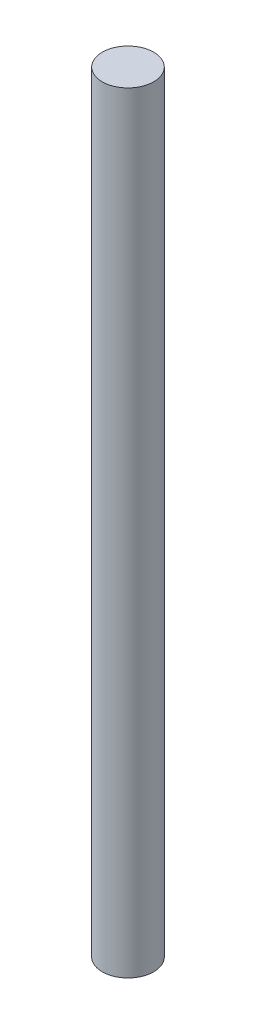
ISO-10303-21;
HEADER;
FILE_DESCRIPTION(('STEP AP214'),'2;1');
FILE_NAME('part.step','',(''),(''),'','','');
FILE_SCHEMA(('AUTOMOTIVE_DESIGN { 1 0 10303 214 1 1 1 1 }'));
ENDSEC;
DATA;
#1=APPLICATION_CONTEXT('core data for automotive mechanical design processes');
#2=APPLICATION_PROTOCOL_DEFINITION('international standard','automotive_design',2000,#1);
#3=PRODUCT_CONTEXT('',#1,'mechanical');
#4=PRODUCT('Part','Part','',(#3));
#5=PRODUCT_RELATED_PRODUCT_CATEGORY('part','',(#4));
#6=PRODUCT_DEFINITION_FORMATION('','',#4);
#7=PRODUCT_DEFINITION_CONTEXT('part definition',#1,'design');
#8=PRODUCT_DEFINITION('design','',#6,#7);
#9=PRODUCT_DEFINITION_SHAPE('','',#8);
#10=(LENGTH_UNIT() NAMED_UNIT(*) SI_UNIT(.MILLI.,.METRE.));
#11=(NAMED_UNIT(*) PLANE_ANGLE_UNIT() SI_UNIT($,.RADIAN.));
#12=(NAMED_UNIT(*) SI_UNIT($,.STERADIAN.) SOLID_ANGLE_UNIT());
#13=UNCERTAINTY_MEASURE_WITH_UNIT(LENGTH_MEASURE(1.E-05),#10,'distance_accuracy_value','');
#14=(GEOMETRIC_REPRESENTATION_CONTEXT(3) GLOBAL_UNCERTAINTY_ASSIGNED_CONTEXT((#13)) GLOBAL_UNIT_ASSIGNED_CONTEXT((#10,
#11,#12)) REPRESENTATION_CONTEXT('',''));
#15=CARTESIAN_POINT('',(0.,0.,0.));
#16=DIRECTION('',(0.,0.,1.));
#17=DIRECTION('',(1.,0.,0.));
#18=AXIS2_PLACEMENT_3D('',#15,#16,#17);
#19=CARTESIAN_POINT('',(0.,120.,0.));
#20=DIRECTION('',(0.,-1.,0.));
#21=DIRECTION('',(0.,0.,-1.));
#22=AXIS2_PLACEMENT_3D('',#19,#20,#21);
#23=CYLINDRICAL_SURFACE('',#22,4.);
#24=CARTESIAN_POINT('',(0.,120.,0.));
#25=DIRECTION('',(0.,1.,0.));
#26=DIRECTION('',(0.,0.,1.));
#27=AXIS2_PLACEMENT_3D('',#24,#25,#26);
#28=CIRCLE('',#27,4.);
#29=CARTESIAN_POINT('',(0.,120.,4.));
#30=VERTEX_POINT('',#29);
#31=EDGE_CURVE('E10',#30,#30,#28,.T.);
#32=ORIENTED_EDGE('',*,*,#31,.F.);
#33=EDGE_LOOP('',(#32));
#34=FACE_BOUND('',#33,.T.);
#35=CARTESIAN_POINT('',(0.,0.,0.));
#36=DIRECTION('',(0.,1.,0.));
#37=DIRECTION('',(0.,0.,1.));
#38=AXIS2_PLACEMENT_3D('',#35,#36,#37);
#39=CIRCLE('',#38,4.);
#40=CARTESIAN_POINT('',(0.,0.,4.));
#41=VERTEX_POINT('',#40);
#42=EDGE_CURVE('E33',#41,#41,#39,.T.);
#43=ORIENTED_EDGE('',*,*,#42,.T.);
#44=EDGE_LOOP('',(#43));
#45=FACE_BOUND('',#44,.T.);
#46=ADVANCED_FACE('F30',(#34,#45),#23,.T.);
#47=CARTESIAN_POINT('',(0.,120.,0.));
#48=DIRECTION('',(0.,1.,0.));
#49=DIRECTION('',(0.,0.,1.));
#50=AXIS2_PLACEMENT_3D('',#47,#48,#49);
#51=PLANE('',#50);
#52=ORIENTED_EDGE('',*,*,#31,.T.);
#53=EDGE_LOOP('',(#52));
#54=FACE_BOUND('',#53,.T.);
#55=ADVANCED_FACE('F45',(#54),#51,.T.);
#56=CARTESIAN_POINT('',(0.,0.,0.));
#57=DIRECTION('',(0.,1.,0.));
#58=DIRECTION('',(0.,0.,1.));
#59=AXIS2_PLACEMENT_3D('',#56,#57,#58);
#60=PLANE('',#59);
#61=ORIENTED_EDGE('',*,*,#42,.F.);
#62=EDGE_LOOP('',(#61));
#63=FACE_BOUND('',#62,.T.);
#64=ADVANCED_FACE('F43',(#63),#60,.F.);
#65=CLOSED_SHELL('',(#46,#55,#64));
#66=MANIFOLD_SOLID_BREP('B2',#65);
#67=ADVANCED_BREP_SHAPE_REPRESENTATION('',(#18,#66),#14);
#68=SHAPE_DEFINITION_REPRESENTATION(#9,#67);
ENDSEC;
END-ISO-10303-21;
